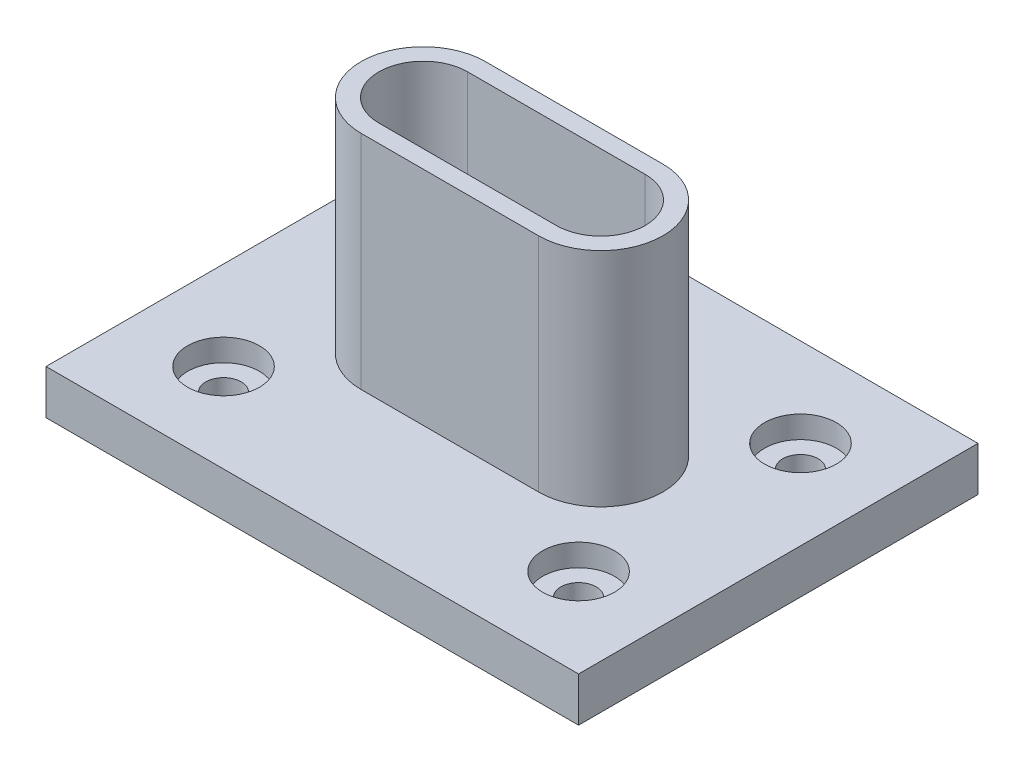
ISO-10303-21;
HEADER;
FILE_DESCRIPTION(('STEP AP214'),'2;1');
FILE_NAME('part.step','',(''),(''),'','','');
FILE_SCHEMA(('AUTOMOTIVE_DESIGN { 1 0 10303 214 1 1 1 1 }'));
ENDSEC;
DATA;
#1=APPLICATION_CONTEXT('core data for automotive mechanical design processes');
#2=APPLICATION_PROTOCOL_DEFINITION('international standard','automotive_design',2000,#1);
#3=PRODUCT_CONTEXT('',#1,'mechanical');
#4=PRODUCT('Part','Part','',(#3));
#5=PRODUCT_RELATED_PRODUCT_CATEGORY('part','',(#4));
#6=PRODUCT_DEFINITION_FORMATION('','',#4);
#7=PRODUCT_DEFINITION_CONTEXT('part definition',#1,'design');
#8=PRODUCT_DEFINITION('design','',#6,#7);
#9=PRODUCT_DEFINITION_SHAPE('','',#8);
#10=(LENGTH_UNIT() NAMED_UNIT(*) SI_UNIT(.MILLI.,.METRE.));
#11=(NAMED_UNIT(*) PLANE_ANGLE_UNIT() SI_UNIT($,.RADIAN.));
#12=(NAMED_UNIT(*) SI_UNIT($,.STERADIAN.) SOLID_ANGLE_UNIT());
#13=UNCERTAINTY_MEASURE_WITH_UNIT(LENGTH_MEASURE(1.E-05),#10,'distance_accuracy_value','');
#14=(GEOMETRIC_REPRESENTATION_CONTEXT(3) GLOBAL_UNCERTAINTY_ASSIGNED_CONTEXT((#13)) GLOBAL_UNIT_ASSIGNED_CONTEXT((#10,
#11,#12)) REPRESENTATION_CONTEXT('',''));
#15=CARTESIAN_POINT('',(0.,0.,0.));
#16=DIRECTION('',(0.,0.,1.));
#17=DIRECTION('',(1.,0.,0.));
#18=AXIS2_PLACEMENT_3D('',#15,#16,#17);
#19=CARTESIAN_POINT('',(-50.8000000000002,-41.7960298322641,-31.75));
#20=DIRECTION('',(0.,1.,0.));
#21=DIRECTION('',(0.,0.,1.));
#22=AXIS2_PLACEMENT_3D('',#19,#20,#21);
#23=CYLINDRICAL_SURFACE('',#22,5.08000000000001);
#24=CARTESIAN_POINT('',(-50.8000000000002,-12.7,-31.75));
#25=DIRECTION('',(0.,1.,0.));
#26=DIRECTION('',(0.,0.,1.));
#27=AXIS2_PLACEMENT_3D('',#24,#25,#26);
#28=CIRCLE('',#27,5.08000000000001);
#29=CARTESIAN_POINT('',(-50.8000000000002,-12.7,-26.67));
#30=VERTEX_POINT('',#29);
#31=EDGE_CURVE('E178',#30,#30,#28,.F.);
#32=ORIENTED_EDGE('',*,*,#31,.T.);
#33=EDGE_LOOP('',(#32));
#34=FACE_BOUND('',#33,.T.);
#35=CARTESIAN_POINT('',(-50.8000000000002,-6.35,-31.75));
#36=DIRECTION('',(0.,1.,0.));
#37=DIRECTION('',(0.,0.,1.));
#38=AXIS2_PLACEMENT_3D('',#35,#36,#37);
#39=CIRCLE('',#38,5.08000000000001);
#40=CARTESIAN_POINT('',(-50.8000000000002,-6.35,-26.67));
#41=VERTEX_POINT('',#40);
#42=EDGE_CURVE('E439',#41,#41,#39,.T.);
#43=ORIENTED_EDGE('',*,*,#42,.T.);
#44=EDGE_LOOP('',(#43));
#45=FACE_BOUND('',#44,.T.);
#46=ADVANCED_FACE('F69',(#34,#45),#23,.F.);
#47=CARTESIAN_POINT('',(-50.8,-41.7960298322641,31.75));
#48=DIRECTION('',(0.,1.,0.));
#49=DIRECTION('',(0.,0.,1.));
#50=AXIS2_PLACEMENT_3D('',#47,#48,#49);
#51=CYLINDRICAL_SURFACE('',#50,5.08000000000001);
#52=CARTESIAN_POINT('',(-50.8,-12.7,31.75));
#53=DIRECTION('',(0.,1.,0.));
#54=DIRECTION('',(0.,0.,1.));
#55=AXIS2_PLACEMENT_3D('',#52,#53,#54);
#56=CIRCLE('',#55,5.08000000000001);
#57=CARTESIAN_POINT('',(-50.8,-12.7,36.83));
#58=VERTEX_POINT('',#57);
#59=EDGE_CURVE('E378',#58,#58,#56,.F.);
#60=ORIENTED_EDGE('',*,*,#59,.T.);
#61=EDGE_LOOP('',(#60));
#62=FACE_BOUND('',#61,.T.);
#63=CARTESIAN_POINT('',(-50.8,-6.35,31.75));
#64=DIRECTION('',(0.,1.,0.));
#65=DIRECTION('',(0.,0.,1.));
#66=AXIS2_PLACEMENT_3D('',#63,#64,#65);
#67=CIRCLE('',#66,5.08000000000001);
#68=CARTESIAN_POINT('',(-50.8,-6.35,36.83));
#69=VERTEX_POINT('',#68);
#70=EDGE_CURVE('E394',#69,#69,#67,.T.);
#71=ORIENTED_EDGE('',*,*,#70,.T.);
#72=EDGE_LOOP('',(#71));
#73=FACE_BOUND('',#72,.T.);
#74=ADVANCED_FACE('F306',(#62,#73),#51,.F.);
#75=CARTESIAN_POINT('',(50.8,-41.7960298322641,31.75));
#76=DIRECTION('',(0.,1.,0.));
#77=DIRECTION('',(0.,0.,1.));
#78=AXIS2_PLACEMENT_3D('',#75,#76,#77);
#79=CYLINDRICAL_SURFACE('',#78,5.08000000000001);
#80=CARTESIAN_POINT('',(50.8,-12.7,31.75));
#81=DIRECTION('',(0.,1.,0.));
#82=DIRECTION('',(0.,0.,1.));
#83=AXIS2_PLACEMENT_3D('',#80,#81,#82);
#84=CIRCLE('',#83,5.08000000000001);
#85=CARTESIAN_POINT('',(50.8,-12.7,36.83));
#86=VERTEX_POINT('',#85);
#87=EDGE_CURVE('E382',#86,#86,#84,.F.);
#88=ORIENTED_EDGE('',*,*,#87,.T.);
#89=EDGE_LOOP('',(#88));
#90=FACE_BOUND('',#89,.T.);
#91=CARTESIAN_POINT('',(50.8,-6.35,31.75));
#92=DIRECTION('',(0.,1.,0.));
#93=DIRECTION('',(0.,0.,1.));
#94=AXIS2_PLACEMENT_3D('',#91,#92,#93);
#95=CIRCLE('',#94,5.08000000000001);
#96=CARTESIAN_POINT('',(50.8,-6.35,36.83));
#97=VERTEX_POINT('',#96);
#98=EDGE_CURVE('E415',#97,#97,#95,.T.);
#99=ORIENTED_EDGE('',*,*,#98,.T.);
#100=EDGE_LOOP('',(#99));
#101=FACE_BOUND('',#100,.T.);
#102=ADVANCED_FACE('F313',(#90,#101),#79,.F.);
#103=CARTESIAN_POINT('',(50.7999999999998,-41.7960298322641,-31.75));
#104=DIRECTION('',(0.,1.,0.));
#105=DIRECTION('',(0.,0.,1.));
#106=AXIS2_PLACEMENT_3D('',#103,#104,#105);
#107=CYLINDRICAL_SURFACE('',#106,5.08000000000001);
#108=CARTESIAN_POINT('',(50.7999999999998,-12.7,-31.75));
#109=DIRECTION('',(0.,1.,0.));
#110=DIRECTION('',(0.,0.,1.));
#111=AXIS2_PLACEMENT_3D('',#108,#109,#110);
#112=CIRCLE('',#111,5.08000000000001);
#113=CARTESIAN_POINT('',(50.7999999999998,-12.7,-26.67));
#114=VERTEX_POINT('',#113);
#115=EDGE_CURVE('E385',#114,#114,#112,.F.);
#116=ORIENTED_EDGE('',*,*,#115,.T.);
#117=EDGE_LOOP('',(#116));
#118=FACE_BOUND('',#117,.T.);
#119=CARTESIAN_POINT('',(50.7999999999998,-6.35,-31.75));
#120=DIRECTION('',(0.,1.,0.));
#121=DIRECTION('',(0.,0.,1.));
#122=AXIS2_PLACEMENT_3D('',#119,#120,#121);
#123=CIRCLE('',#122,5.08000000000001);
#124=CARTESIAN_POINT('',(50.7999999999998,-6.35,-26.67));
#125=VERTEX_POINT('',#124);
#126=EDGE_CURVE('E427',#125,#125,#123,.T.);
#127=ORIENTED_EDGE('',*,*,#126,.T.);
#128=EDGE_LOOP('',(#127));
#129=FACE_BOUND('',#128,.T.);
#130=ADVANCED_FACE('F346',(#118,#129),#107,.F.);
#131=CARTESIAN_POINT('',(0.,0.,0.));
#132=DIRECTION('',(0.,1.,0.));
#133=DIRECTION('',(0.,0.,1.));
#134=AXIS2_PLACEMENT_3D('',#131,#132,#133);
#135=PLANE('',#134);
#136=CARTESIAN_POINT('',(50.8,0.,31.75));
#137=DIRECTION('',(0.,1.,0.));
#138=DIRECTION('',(0.,0.,1.));
#139=AXIS2_PLACEMENT_3D('',#136,#137,#138);
#140=CIRCLE('',#139,10.287);
#141=CARTESIAN_POINT('',(50.8,0.,42.037));
#142=VERTEX_POINT('',#141);
#143=EDGE_CURVE('E411',#142,#142,#140,.T.);
#144=ORIENTED_EDGE('',*,*,#143,.F.);
#145=EDGE_LOOP('',(#144));
#146=FACE_BOUND('',#145,.T.);
#147=CARTESIAN_POINT('',(50.7999999999998,0.,-31.75));
#148=DIRECTION('',(0.,1.,0.));
#149=DIRECTION('',(0.,0.,1.));
#150=AXIS2_PLACEMENT_3D('',#147,#148,#149);
#151=CIRCLE('',#150,10.287);
#152=CARTESIAN_POINT('',(50.7999999999998,0.,-21.463));
#153=VERTEX_POINT('',#152);
#154=EDGE_CURVE('E420',#153,#153,#151,.T.);
#155=ORIENTED_EDGE('',*,*,#154,.F.);
#156=EDGE_LOOP('',(#155));
#157=FACE_BOUND('',#156,.T.);
#158=CARTESIAN_POINT('',(-50.8000000000002,0.,-31.75));
#159=DIRECTION('',(0.,1.,0.));
#160=DIRECTION('',(0.,0.,1.));
#161=AXIS2_PLACEMENT_3D('',#158,#159,#160);
#162=CIRCLE('',#161,10.287);
#163=CARTESIAN_POINT('',(-50.8000000000002,0.,-21.463));
#164=VERTEX_POINT('',#163);
#165=EDGE_CURVE('E432',#164,#164,#162,.T.);
#166=ORIENTED_EDGE('',*,*,#165,.F.);
#167=EDGE_LOOP('',(#166));
#168=FACE_BOUND('',#167,.T.);
#169=CARTESIAN_POINT('',(-50.8,0.,31.75));
#170=DIRECTION('',(0.,1.,0.));
#171=DIRECTION('',(0.,0.,1.));
#172=AXIS2_PLACEMENT_3D('',#169,#170,#171);
#173=CIRCLE('',#172,10.287);
#174=CARTESIAN_POINT('',(-50.8,0.,42.037));
#175=VERTEX_POINT('',#174);
#176=EDGE_CURVE('E397',#175,#175,#173,.T.);
#177=ORIENTED_EDGE('',*,*,#176,.F.);
#178=EDGE_LOOP('',(#177));
#179=FACE_BOUND('',#178,.T.);
#180=DIRECTION('',(0.,0.,-1.));
#181=VECTOR('',#180,1.);
#182=CARTESIAN_POINT('',(-76.2,0.,0.));
#183=LINE('',#182,#181);
#184=CARTESIAN_POINT('',(-76.2,0.,57.15));
#185=VERTEX_POINT('',#184);
#186=CARTESIAN_POINT('',(-76.2,0.,-57.15));
#187=VERTEX_POINT('',#186);
#188=EDGE_CURVE('E232',#185,#187,#183,.T.);
#189=ORIENTED_EDGE('',*,*,#188,.F.);
#190=DIRECTION('',(-1.,0.,0.));
#191=VECTOR('',#190,1.);
#192=CARTESIAN_POINT('',(0.,0.,57.15));
#193=LINE('',#192,#191);
#194=CARTESIAN_POINT('',(76.2,0.,57.15));
#195=VERTEX_POINT('',#194);
#196=EDGE_CURVE('E263',#195,#185,#193,.T.);
#197=ORIENTED_EDGE('',*,*,#196,.F.);
#198=DIRECTION('',(0.,0.,-1.));
#199=VECTOR('',#198,1.);
#200=CARTESIAN_POINT('',(76.2,0.,0.));
#201=LINE('',#200,#199);
#202=CARTESIAN_POINT('',(76.2,0.,-57.15));
#203=VERTEX_POINT('',#202);
#204=EDGE_CURVE('E266',#195,#203,#201,.T.);
#205=ORIENTED_EDGE('',*,*,#204,.T.);
#206=DIRECTION('',(-1.,0.,0.));
#207=VECTOR('',#206,1.);
#208=CARTESIAN_POINT('',(0.,0.,-57.15));
#209=LINE('',#208,#207);
#210=EDGE_CURVE('E236',#203,#187,#209,.T.);
#211=ORIENTED_EDGE('',*,*,#210,.T.);
#212=EDGE_LOOP('',(#189,#197,#205,#211));
#213=FACE_BOUND('',#212,.T.);
#214=DIRECTION('',(1.,0.,0.));
#215=VECTOR('',#214,1.);
#216=CARTESIAN_POINT('',(-25.4,0.,17.78));
#217=LINE('',#216,#215);
#218=CARTESIAN_POINT('',(-25.4,0.,17.78));
#219=VERTEX_POINT('',#218);
#220=CARTESIAN_POINT('',(25.4,0.,17.78));
#221=VERTEX_POINT('',#220);
#222=EDGE_CURVE('E87',#219,#221,#217,.T.);
#223=ORIENTED_EDGE('',*,*,#222,.F.);
#224=CARTESIAN_POINT('',(-25.4,0.,0.));
#225=DIRECTION('',(0.,1.,0.));
#226=DIRECTION('',(1.,0.,0.));
#227=AXIS2_PLACEMENT_3D('',#224,#225,#226);
#228=CIRCLE('',#227,17.78);
#229=CARTESIAN_POINT('',(-25.4,0.,-17.78));
#230=VERTEX_POINT('',#229);
#231=EDGE_CURVE('E192',#230,#219,#228,.T.);
#232=ORIENTED_EDGE('',*,*,#231,.F.);
#233=DIRECTION('',(1.,0.,0.));
#234=VECTOR('',#233,1.);
#235=CARTESIAN_POINT('',(-25.4,0.,-17.78));
#236=LINE('',#235,#234);
#237=CARTESIAN_POINT('',(25.4,0.,-17.78));
#238=VERTEX_POINT('',#237);
#239=EDGE_CURVE('E198',#230,#238,#236,.T.);
#240=ORIENTED_EDGE('',*,*,#239,.T.);
#241=CARTESIAN_POINT('',(25.4,0.,0.));
#242=DIRECTION('',(0.,1.,0.));
#243=DIRECTION('',(1.,0.,0.));
#244=AXIS2_PLACEMENT_3D('',#241,#242,#243);
#245=CIRCLE('',#244,17.78);
#246=EDGE_CURVE('E92',#221,#238,#245,.T.);
#247=ORIENTED_EDGE('',*,*,#246,.F.);
#248=EDGE_LOOP('',(#223,#232,#240,#247));
#249=FACE_BOUND('',#248,.T.);
#250=ADVANCED_FACE('F342',(#146,#157,#168,#179,#213,#249),#135,.T.);
#251=CARTESIAN_POINT('',(-76.2,-12.7,0.));
#252=DIRECTION('',(1.,0.,0.));
#253=DIRECTION('',(0.,0.,-1.));
#254=AXIS2_PLACEMENT_3D('',#251,#252,#253);
#255=PLANE('',#254);
#256=ORIENTED_EDGE('',*,*,#188,.T.);
#257=DIRECTION('',(0.,1.,0.));
#258=VECTOR('',#257,1.);
#259=CARTESIAN_POINT('',(-76.2,-12.7,-57.15));
#260=LINE('',#259,#258);
#261=CARTESIAN_POINT('',(-76.2,-12.7,-57.15));
#262=VERTEX_POINT('',#261);
#263=EDGE_CURVE('E12',#262,#187,#260,.T.);
#264=ORIENTED_EDGE('',*,*,#263,.F.);
#265=DIRECTION('',(0.,0.,-1.));
#266=VECTOR('',#265,1.);
#267=CARTESIAN_POINT('',(-76.2,-12.7,0.));
#268=LINE('',#267,#266);
#269=CARTESIAN_POINT('',(-76.2,-12.7,57.15));
#270=VERTEX_POINT('',#269);
#271=EDGE_CURVE('E246',#270,#262,#268,.T.);
#272=ORIENTED_EDGE('',*,*,#271,.F.);
#273=DIRECTION('',(0.,1.,0.));
#274=VECTOR('',#273,1.);
#275=CARTESIAN_POINT('',(-76.2,-12.7,57.15));
#276=LINE('',#275,#274);
#277=EDGE_CURVE('E278',#270,#185,#276,.T.);
#278=ORIENTED_EDGE('',*,*,#277,.T.);
#279=EDGE_LOOP('',(#256,#264,#272,#278));
#280=FACE_BOUND('',#279,.T.);
#281=ADVANCED_FACE('F345',(#280),#255,.F.);
#282=CARTESIAN_POINT('',(0.,-12.7,-57.15));
#283=DIRECTION('',(0.,0.,-1.));
#284=DIRECTION('',(-1.,0.,0.));
#285=AXIS2_PLACEMENT_3D('',#282,#283,#284);
#286=PLANE('',#285);
#287=ORIENTED_EDGE('',*,*,#210,.F.);
#288=DIRECTION('',(0.,1.,0.));
#289=VECTOR('',#288,1.);
#290=CARTESIAN_POINT('',(76.2,-12.7,-57.15));
#291=LINE('',#290,#289);
#292=CARTESIAN_POINT('',(76.2,-12.7,-57.15));
#293=VERTEX_POINT('',#292);
#294=EDGE_CURVE('E79',#293,#203,#291,.T.);
#295=ORIENTED_EDGE('',*,*,#294,.F.);
#296=DIRECTION('',(-1.,0.,0.));
#297=VECTOR('',#296,1.);
#298=CARTESIAN_POINT('',(0.,-12.7,-57.15));
#299=LINE('',#298,#297);
#300=EDGE_CURVE('E256',#293,#262,#299,.T.);
#301=ORIENTED_EDGE('',*,*,#300,.T.);
#302=ORIENTED_EDGE('',*,*,#263,.T.);
#303=EDGE_LOOP('',(#287,#295,#301,#302));
#304=FACE_BOUND('',#303,.T.);
#305=ADVANCED_FACE('F348',(#304),#286,.T.);
#306=CARTESIAN_POINT('',(76.2,-12.7,0.));
#307=DIRECTION('',(1.,0.,0.));
#308=DIRECTION('',(0.,0.,-1.));
#309=AXIS2_PLACEMENT_3D('',#306,#307,#308);
#310=PLANE('',#309);
#311=ORIENTED_EDGE('',*,*,#204,.F.);
#312=DIRECTION('',(0.,1.,0.));
#313=VECTOR('',#312,1.);
#314=CARTESIAN_POINT('',(76.2,-12.7,57.15));
#315=LINE('',#314,#313);
#316=CARTESIAN_POINT('',(76.2,-12.7,57.15));
#317=VERTEX_POINT('',#316);
#318=EDGE_CURVE('E275',#317,#195,#315,.T.);
#319=ORIENTED_EDGE('',*,*,#318,.F.);
#320=DIRECTION('',(0.,0.,-1.));
#321=VECTOR('',#320,1.);
#322=CARTESIAN_POINT('',(76.2,-12.7,0.));
#323=LINE('',#322,#321);
#324=EDGE_CURVE('E252',#317,#293,#323,.T.);
#325=ORIENTED_EDGE('',*,*,#324,.T.);
#326=ORIENTED_EDGE('',*,*,#294,.T.);
#327=EDGE_LOOP('',(#311,#319,#325,#326));
#328=FACE_BOUND('',#327,.T.);
#329=ADVANCED_FACE('F303',(#328),#310,.T.);
#330=CARTESIAN_POINT('',(25.4,-12.7,0.));
#331=DIRECTION('',(0.,1.,0.));
#332=DIRECTION('',(0.,0.,1.));
#333=AXIS2_PLACEMENT_3D('',#330,#331,#332);
#334=CYLINDRICAL_SURFACE('',#333,12.7);
#335=DIRECTION('',(0.,1.,0.));
#336=VECTOR('',#335,1.);
#337=CARTESIAN_POINT('',(25.4,-12.7,12.7));
#338=LINE('',#337,#336);
#339=CARTESIAN_POINT('',(25.4,-12.7,12.7));
#340=VERTEX_POINT('',#339);
#341=CARTESIAN_POINT('',(25.4,63.5,12.7));
#342=VERTEX_POINT('',#341);
#343=EDGE_CURVE('E73',#340,#342,#338,.T.);
#344=ORIENTED_EDGE('',*,*,#343,.T.);
#345=CARTESIAN_POINT('',(25.4,63.5,0.));
#346=DIRECTION('',(0.,1.,0.));
#347=DIRECTION('',(0.,0.,1.));
#348=AXIS2_PLACEMENT_3D('',#345,#346,#347);
#349=CIRCLE('',#348,12.7);
#350=CARTESIAN_POINT('',(25.4,63.5,-12.7));
#351=VERTEX_POINT('',#350);
#352=EDGE_CURVE('E182',#342,#351,#349,.T.);
#353=ORIENTED_EDGE('',*,*,#352,.T.);
#354=DIRECTION('',(0.,1.,0.));
#355=VECTOR('',#354,1.);
#356=CARTESIAN_POINT('',(25.4,-12.7,-12.7));
#357=LINE('',#356,#355);
#358=CARTESIAN_POINT('',(25.4,-12.7,-12.7));
#359=VERTEX_POINT('',#358);
#360=EDGE_CURVE('E282',#359,#351,#357,.T.);
#361=ORIENTED_EDGE('',*,*,#360,.F.);
#362=CARTESIAN_POINT('',(25.4,-12.7,0.));
#363=DIRECTION('',(0.,1.,0.));
#364=DIRECTION('',(0.,0.,1.));
#365=AXIS2_PLACEMENT_3D('',#362,#363,#364);
#366=CIRCLE('',#365,12.7);
#367=EDGE_CURVE('E233',#340,#359,#366,.T.);
#368=ORIENTED_EDGE('',*,*,#367,.F.);
#369=EDGE_LOOP('',(#344,#353,#361,#368));
#370=FACE_BOUND('',#369,.T.);
#371=ADVANCED_FACE('F71',(#370),#334,.F.);
#372=CARTESIAN_POINT('',(0.,-12.7,-12.7));
#373=DIRECTION('',(0.,0.,1.));
#374=DIRECTION('',(1.,0.,0.));
#375=AXIS2_PLACEMENT_3D('',#372,#373,#374);
#376=PLANE('',#375);
#377=ORIENTED_EDGE('',*,*,#360,.T.);
#378=DIRECTION('',(1.,0.,0.));
#379=VECTOR('',#378,1.);
#380=CARTESIAN_POINT('',(-25.4,63.5,-12.7));
#381=LINE('',#380,#379);
#382=CARTESIAN_POINT('',(-25.4,63.5,-12.7));
#383=VERTEX_POINT('',#382);
#384=EDGE_CURVE('E186',#383,#351,#381,.T.);
#385=ORIENTED_EDGE('',*,*,#384,.F.);
#386=DIRECTION('',(0.,1.,0.));
#387=VECTOR('',#386,1.);
#388=CARTESIAN_POINT('',(-25.4,-12.7,-12.7));
#389=LINE('',#388,#387);
#390=CARTESIAN_POINT('',(-25.4,-12.7,-12.7));
#391=VERTEX_POINT('',#390);
#392=EDGE_CURVE('E170',#391,#383,#389,.T.);
#393=ORIENTED_EDGE('',*,*,#392,.F.);
#394=DIRECTION('',(1.,0.,0.));
#395=VECTOR('',#394,1.);
#396=CARTESIAN_POINT('',(0.,-12.7,-12.7));
#397=LINE('',#396,#395);
#398=EDGE_CURVE('E242',#391,#359,#397,.T.);
#399=ORIENTED_EDGE('',*,*,#398,.T.);
#400=EDGE_LOOP('',(#377,#385,#393,#399));
#401=FACE_BOUND('',#400,.T.);
#402=ADVANCED_FACE('F295',(#401),#376,.T.);
#403=CARTESIAN_POINT('',(-25.4,-12.7,0.));
#404=DIRECTION('',(0.,1.,0.));
#405=DIRECTION('',(0.,0.,1.));
#406=AXIS2_PLACEMENT_3D('',#403,#404,#405);
#407=CYLINDRICAL_SURFACE('',#406,12.7);
#408=ORIENTED_EDGE('',*,*,#392,.T.);
#409=CARTESIAN_POINT('',(-25.4,63.5,0.));
#410=DIRECTION('',(0.,1.,0.));
#411=DIRECTION('',(0.,0.,1.));
#412=AXIS2_PLACEMENT_3D('',#409,#410,#411);
#413=CIRCLE('',#412,12.7);
#414=CARTESIAN_POINT('',(-25.4,63.5,12.7));
#415=VERTEX_POINT('',#414);
#416=EDGE_CURVE('E172',#383,#415,#413,.T.);
#417=ORIENTED_EDGE('',*,*,#416,.T.);
#418=DIRECTION('',(0.,1.,0.));
#419=VECTOR('',#418,1.);
#420=CARTESIAN_POINT('',(-25.4,-12.7,12.7));
#421=LINE('',#420,#419);
#422=CARTESIAN_POINT('',(-25.4,-12.7,12.7));
#423=VERTEX_POINT('',#422);
#424=EDGE_CURVE('E159',#423,#415,#421,.T.);
#425=ORIENTED_EDGE('',*,*,#424,.F.);
#426=CARTESIAN_POINT('',(-25.4,-12.7,0.));
#427=DIRECTION('',(0.,1.,0.));
#428=DIRECTION('',(0.,0.,1.));
#429=AXIS2_PLACEMENT_3D('',#426,#427,#428);
#430=CIRCLE('',#429,12.7);
#431=EDGE_CURVE('E239',#391,#423,#430,.T.);
#432=ORIENTED_EDGE('',*,*,#431,.F.);
#433=EDGE_LOOP('',(#408,#417,#425,#432));
#434=FACE_BOUND('',#433,.T.);
#435=ADVANCED_FACE('F173',(#434),#407,.F.);
#436=CARTESIAN_POINT('',(0.,-12.7,12.7));
#437=DIRECTION('',(0.,0.,1.));
#438=DIRECTION('',(1.,0.,0.));
#439=AXIS2_PLACEMENT_3D('',#436,#437,#438);
#440=PLANE('',#439);
#441=ORIENTED_EDGE('',*,*,#424,.T.);
#442=DIRECTION('',(1.,0.,0.));
#443=VECTOR('',#442,1.);
#444=CARTESIAN_POINT('',(-25.4,63.5,12.7));
#445=LINE('',#444,#443);
#446=EDGE_CURVE('E164',#415,#342,#445,.T.);
#447=ORIENTED_EDGE('',*,*,#446,.T.);
#448=ORIENTED_EDGE('',*,*,#343,.F.);
#449=DIRECTION('',(1.,0.,0.));
#450=VECTOR('',#449,1.);
#451=CARTESIAN_POINT('',(0.,-12.7,12.7));
#452=LINE('',#451,#450);
#453=EDGE_CURVE('E166',#423,#340,#452,.T.);
#454=ORIENTED_EDGE('',*,*,#453,.F.);
#455=EDGE_LOOP('',(#441,#447,#448,#454));
#456=FACE_BOUND('',#455,.T.);
#457=ADVANCED_FACE('F161',(#456),#440,.F.);
#458=CARTESIAN_POINT('',(0.,-12.7,57.15));
#459=DIRECTION('',(0.,0.,-1.));
#460=DIRECTION('',(-1.,0.,0.));
#461=AXIS2_PLACEMENT_3D('',#458,#459,#460);
#462=PLANE('',#461);
#463=ORIENTED_EDGE('',*,*,#196,.T.);
#464=ORIENTED_EDGE('',*,*,#277,.F.);
#465=DIRECTION('',(-1.,0.,0.));
#466=VECTOR('',#465,1.);
#467=CARTESIAN_POINT('',(0.,-12.7,57.15));
#468=LINE('',#467,#466);
#469=EDGE_CURVE('E249',#317,#270,#468,.T.);
#470=ORIENTED_EDGE('',*,*,#469,.F.);
#471=ORIENTED_EDGE('',*,*,#318,.T.);
#472=EDGE_LOOP('',(#463,#464,#470,#471));
#473=FACE_BOUND('',#472,.T.);
#474=ADVANCED_FACE('F341',(#473),#462,.F.);
#475=CARTESIAN_POINT('',(0.,-12.7,0.));
#476=DIRECTION('',(0.,1.,0.));
#477=DIRECTION('',(0.,0.,1.));
#478=AXIS2_PLACEMENT_3D('',#475,#476,#477);
#479=PLANE('',#478);
#480=ORIENTED_EDGE('',*,*,#367,.T.);
#481=ORIENTED_EDGE('',*,*,#398,.F.);
#482=ORIENTED_EDGE('',*,*,#431,.T.);
#483=ORIENTED_EDGE('',*,*,#453,.T.);
#484=EDGE_LOOP('',(#480,#481,#482,#483));
#485=FACE_BOUND('',#484,.T.);
#486=ORIENTED_EDGE('',*,*,#271,.T.);
#487=ORIENTED_EDGE('',*,*,#300,.F.);
#488=ORIENTED_EDGE('',*,*,#324,.F.);
#489=ORIENTED_EDGE('',*,*,#469,.T.);
#490=EDGE_LOOP('',(#486,#487,#488,#489));
#491=FACE_BOUND('',#490,.T.);
#492=ORIENTED_EDGE('',*,*,#31,.F.);
#493=EDGE_LOOP('',(#492));
#494=FACE_BOUND('',#493,.T.);
#495=ORIENTED_EDGE('',*,*,#59,.F.);
#496=EDGE_LOOP('',(#495));
#497=FACE_BOUND('',#496,.T.);
#498=ORIENTED_EDGE('',*,*,#87,.F.);
#499=EDGE_LOOP('',(#498));
#500=FACE_BOUND('',#499,.T.);
#501=ORIENTED_EDGE('',*,*,#115,.F.);
#502=EDGE_LOOP('',(#501));
#503=FACE_BOUND('',#502,.T.);
#504=ADVANCED_FACE('F292',(#485,#491,#494,#497,#500,#503),#479,.F.);
#505=CARTESIAN_POINT('',(-25.4,63.5,0.));
#506=DIRECTION('',(0.,1.,0.));
#507=DIRECTION('',(0.,0.,1.));
#508=AXIS2_PLACEMENT_3D('',#505,#506,#507);
#509=PLANE('',#508);
#510=CARTESIAN_POINT('',(-25.4,63.5,0.));
#511=DIRECTION('',(0.,1.,0.));
#512=DIRECTION('',(1.,0.,0.));
#513=AXIS2_PLACEMENT_3D('',#510,#511,#512);
#514=CIRCLE('',#513,17.78);
#515=CARTESIAN_POINT('',(-25.4,63.5,-17.78));
#516=VERTEX_POINT('',#515);
#517=CARTESIAN_POINT('',(-25.4,63.5,17.78));
#518=VERTEX_POINT('',#517);
#519=EDGE_CURVE('E193',#516,#518,#514,.T.);
#520=ORIENTED_EDGE('',*,*,#519,.T.);
#521=DIRECTION('',(1.,0.,0.));
#522=VECTOR('',#521,1.);
#523=CARTESIAN_POINT('',(-25.4,63.5,17.78));
#524=LINE('',#523,#522);
#525=CARTESIAN_POINT('',(25.4,63.5,17.78));
#526=VERTEX_POINT('',#525);
#527=EDGE_CURVE('E197',#518,#526,#524,.T.);
#528=ORIENTED_EDGE('',*,*,#527,.T.);
#529=CARTESIAN_POINT('',(25.4,63.5,0.));
#530=DIRECTION('',(0.,1.,0.));
#531=DIRECTION('',(1.,0.,0.));
#532=AXIS2_PLACEMENT_3D('',#529,#530,#531);
#533=CIRCLE('',#532,17.78);
#534=CARTESIAN_POINT('',(25.4,63.5,-17.78));
#535=VERTEX_POINT('',#534);
#536=EDGE_CURVE('E201',#526,#535,#533,.T.);
#537=ORIENTED_EDGE('',*,*,#536,.T.);
#538=DIRECTION('',(1.,0.,0.));
#539=VECTOR('',#538,1.);
#540=CARTESIAN_POINT('',(-25.4,63.5,-17.78));
#541=LINE('',#540,#539);
#542=EDGE_CURVE('E204',#516,#535,#541,.T.);
#543=ORIENTED_EDGE('',*,*,#542,.F.);
#544=EDGE_LOOP('',(#520,#528,#537,#543));
#545=FACE_BOUND('',#544,.T.);
#546=ORIENTED_EDGE('',*,*,#446,.F.);
#547=ORIENTED_EDGE('',*,*,#416,.F.);
#548=ORIENTED_EDGE('',*,*,#384,.T.);
#549=ORIENTED_EDGE('',*,*,#352,.F.);
#550=EDGE_LOOP('',(#546,#547,#548,#549));
#551=FACE_BOUND('',#550,.T.);
#552=ADVANCED_FACE('F180',(#545,#551),#509,.T.);
#553=CARTESIAN_POINT('',(-25.4,63.5,0.));
#554=DIRECTION('',(0.,-1.,0.));
#555=DIRECTION('',(0.,0.,-1.));
#556=AXIS2_PLACEMENT_3D('',#553,#554,#555);
#557=CYLINDRICAL_SURFACE('',#556,17.78);
#558=ORIENTED_EDGE('',*,*,#231,.T.);
#559=DIRECTION('',(0.,-1.,0.));
#560=VECTOR('',#559,1.);
#561=CARTESIAN_POINT('',(-25.4,63.5,17.78));
#562=LINE('',#561,#560);
#563=EDGE_CURVE('E229',#518,#219,#562,.T.);
#564=ORIENTED_EDGE('',*,*,#563,.F.);
#565=ORIENTED_EDGE('',*,*,#519,.F.);
#566=DIRECTION('',(0.,-1.,0.));
#567=VECTOR('',#566,1.);
#568=CARTESIAN_POINT('',(-25.4,63.5,-17.78));
#569=LINE('',#568,#567);
#570=EDGE_CURVE('E208',#516,#230,#569,.T.);
#571=ORIENTED_EDGE('',*,*,#570,.T.);
#572=EDGE_LOOP('',(#558,#564,#565,#571));
#573=FACE_BOUND('',#572,.T.);
#574=ADVANCED_FACE('F322',(#573),#557,.T.);
#575=CARTESIAN_POINT('',(-25.4,63.5,17.78));
#576=DIRECTION('',(0.,0.,-1.));
#577=DIRECTION('',(-1.,0.,0.));
#578=AXIS2_PLACEMENT_3D('',#575,#576,#577);
#579=PLANE('',#578);
#580=ORIENTED_EDGE('',*,*,#222,.T.);
#581=DIRECTION('',(0.,-1.,0.));
#582=VECTOR('',#581,1.);
#583=CARTESIAN_POINT('',(25.4,63.5,17.78));
#584=LINE('',#583,#582);
#585=EDGE_CURVE('E225',#526,#221,#584,.T.);
#586=ORIENTED_EDGE('',*,*,#585,.F.);
#587=ORIENTED_EDGE('',*,*,#527,.F.);
#588=ORIENTED_EDGE('',*,*,#563,.T.);
#589=EDGE_LOOP('',(#580,#586,#587,#588));
#590=FACE_BOUND('',#589,.T.);
#591=ADVANCED_FACE('F332',(#590),#579,.F.);
#592=CARTESIAN_POINT('',(25.4,63.5,0.));
#593=DIRECTION('',(0.,-1.,0.));
#594=DIRECTION('',(0.,0.,-1.));
#595=AXIS2_PLACEMENT_3D('',#592,#593,#594);
#596=CYLINDRICAL_SURFACE('',#595,17.78);
#597=ORIENTED_EDGE('',*,*,#246,.T.);
#598=DIRECTION('',(0.,-1.,0.));
#599=VECTOR('',#598,1.);
#600=CARTESIAN_POINT('',(25.4,63.5,-17.78));
#601=LINE('',#600,#599);
#602=EDGE_CURVE('E221',#535,#238,#601,.T.);
#603=ORIENTED_EDGE('',*,*,#602,.F.);
#604=ORIENTED_EDGE('',*,*,#536,.F.);
#605=ORIENTED_EDGE('',*,*,#585,.T.);
#606=EDGE_LOOP('',(#597,#603,#604,#605));
#607=FACE_BOUND('',#606,.T.);
#608=ADVANCED_FACE('F328',(#607),#596,.T.);
#609=CARTESIAN_POINT('',(-25.4,63.5,-17.78));
#610=DIRECTION('',(0.,0.,-1.));
#611=DIRECTION('',(-1.,0.,0.));
#612=AXIS2_PLACEMENT_3D('',#609,#610,#611);
#613=PLANE('',#612);
#614=ORIENTED_EDGE('',*,*,#239,.F.);
#615=ORIENTED_EDGE('',*,*,#570,.F.);
#616=ORIENTED_EDGE('',*,*,#542,.T.);
#617=ORIENTED_EDGE('',*,*,#602,.T.);
#618=EDGE_LOOP('',(#614,#615,#616,#617));
#619=FACE_BOUND('',#618,.T.);
#620=ADVANCED_FACE('F324',(#619),#613,.T.);
#621=CARTESIAN_POINT('',(50.7999999999998,-6.35,-31.75));
#622=DIRECTION('',(0.,1.,0.));
#623=DIRECTION('',(0.,0.,1.));
#624=AXIS2_PLACEMENT_3D('',#621,#622,#623);
#625=CYLINDRICAL_SURFACE('',#624,10.287);
#626=CARTESIAN_POINT('',(50.7999999999998,-6.35,-31.75));
#627=DIRECTION('',(0.,1.,0.));
#628=DIRECTION('',(0.,0.,1.));
#629=AXIS2_PLACEMENT_3D('',#626,#627,#628);
#630=CIRCLE('',#629,10.287);
#631=CARTESIAN_POINT('',(50.7999999999998,-6.35,-21.463));
#632=VERTEX_POINT('',#631);
#633=EDGE_CURVE('E428',#632,#632,#630,.T.);
#634=ORIENTED_EDGE('',*,*,#633,.F.);
#635=EDGE_LOOP('',(#634));
#636=FACE_BOUND('',#635,.T.);
#637=ORIENTED_EDGE('',*,*,#154,.T.);
#638=EDGE_LOOP('',(#637));
#639=FACE_BOUND('',#638,.T.);
#640=ADVANCED_FACE('F327',(#636,#639),#625,.F.);
#641=CARTESIAN_POINT('',(0.,-6.35,0.));
#642=DIRECTION('',(0.,1.,0.));
#643=DIRECTION('',(0.,0.,1.));
#644=AXIS2_PLACEMENT_3D('',#641,#642,#643);
#645=PLANE('',#644);
#646=ORIENTED_EDGE('',*,*,#126,.F.);
#647=EDGE_LOOP('',(#646));
#648=FACE_BOUND('',#647,.T.);
#649=ORIENTED_EDGE('',*,*,#633,.T.);
#650=EDGE_LOOP('',(#649));
#651=FACE_BOUND('',#650,.T.);
#652=ADVANCED_FACE('F491',(#648,#651),#645,.T.);
#653=CARTESIAN_POINT('',(50.8,-6.35,31.75));
#654=DIRECTION('',(0.,1.,0.));
#655=DIRECTION('',(0.,0.,1.));
#656=AXIS2_PLACEMENT_3D('',#653,#654,#655);
#657=CYLINDRICAL_SURFACE('',#656,10.287);
#658=CARTESIAN_POINT('',(50.8,-6.35,31.75));
#659=DIRECTION('',(0.,1.,0.));
#660=DIRECTION('',(0.,0.,1.));
#661=AXIS2_PLACEMENT_3D('',#658,#659,#660);
#662=CIRCLE('',#661,10.287);
#663=CARTESIAN_POINT('',(50.8,-6.35,42.037));
#664=VERTEX_POINT('',#663);
#665=EDGE_CURVE('E416',#664,#664,#662,.T.);
#666=ORIENTED_EDGE('',*,*,#665,.F.);
#667=EDGE_LOOP('',(#666));
#668=FACE_BOUND('',#667,.T.);
#669=ORIENTED_EDGE('',*,*,#143,.T.);
#670=EDGE_LOOP('',(#669));
#671=FACE_BOUND('',#670,.T.);
#672=ADVANCED_FACE('F473',(#668,#671),#657,.F.);
#673=CARTESIAN_POINT('',(0.,-6.35,0.));
#674=DIRECTION('',(0.,1.,0.));
#675=DIRECTION('',(0.,0.,1.));
#676=AXIS2_PLACEMENT_3D('',#673,#674,#675);
#677=PLANE('',#676);
#678=ORIENTED_EDGE('',*,*,#98,.F.);
#679=EDGE_LOOP('',(#678));
#680=FACE_BOUND('',#679,.T.);
#681=ORIENTED_EDGE('',*,*,#665,.T.);
#682=EDGE_LOOP('',(#681));
#683=FACE_BOUND('',#682,.T.);
#684=ADVANCED_FACE('F465',(#680,#683),#677,.T.);
#685=CARTESIAN_POINT('',(-50.8,-6.35,31.75));
#686=DIRECTION('',(0.,1.,0.));
#687=DIRECTION('',(0.,0.,1.));
#688=AXIS2_PLACEMENT_3D('',#685,#686,#687);
#689=CYLINDRICAL_SURFACE('',#688,10.287);
#690=CARTESIAN_POINT('',(-50.8,-6.35,31.75));
#691=DIRECTION('',(0.,1.,0.));
#692=DIRECTION('',(0.,0.,1.));
#693=AXIS2_PLACEMENT_3D('',#690,#691,#692);
#694=CIRCLE('',#693,10.287);
#695=CARTESIAN_POINT('',(-50.8,-6.35,42.037));
#696=VERTEX_POINT('',#695);
#697=EDGE_CURVE('E388',#696,#696,#694,.T.);
#698=ORIENTED_EDGE('',*,*,#697,.F.);
#699=EDGE_LOOP('',(#698));
#700=FACE_BOUND('',#699,.T.);
#701=ORIENTED_EDGE('',*,*,#176,.T.);
#702=EDGE_LOOP('',(#701));
#703=FACE_BOUND('',#702,.T.);
#704=ADVANCED_FACE('F463',(#700,#703),#689,.F.);
#705=CARTESIAN_POINT('',(0.,-6.35,0.));
#706=DIRECTION('',(0.,1.,0.));
#707=DIRECTION('',(0.,0.,1.));
#708=AXIS2_PLACEMENT_3D('',#705,#706,#707);
#709=PLANE('',#708);
#710=ORIENTED_EDGE('',*,*,#70,.F.);
#711=EDGE_LOOP('',(#710));
#712=FACE_BOUND('',#711,.T.);
#713=ORIENTED_EDGE('',*,*,#697,.T.);
#714=EDGE_LOOP('',(#713));
#715=FACE_BOUND('',#714,.T.);
#716=ADVANCED_FACE('F456',(#712,#715),#709,.T.);
#717=CARTESIAN_POINT('',(-50.8000000000002,-6.35,-31.75));
#718=DIRECTION('',(0.,1.,0.));
#719=DIRECTION('',(0.,0.,1.));
#720=AXIS2_PLACEMENT_3D('',#717,#718,#719);
#721=CYLINDRICAL_SURFACE('',#720,10.287);
#722=CARTESIAN_POINT('',(-50.8000000000002,-6.35,-31.75));
#723=DIRECTION('',(0.,1.,0.));
#724=DIRECTION('',(0.,0.,1.));
#725=AXIS2_PLACEMENT_3D('',#722,#723,#724);
#726=CIRCLE('',#725,10.287);
#727=CARTESIAN_POINT('',(-50.8000000000002,-6.35,-21.463));
#728=VERTEX_POINT('',#727);
#729=EDGE_CURVE('E409',#728,#728,#726,.T.);
#730=ORIENTED_EDGE('',*,*,#729,.F.);
#731=EDGE_LOOP('',(#730));
#732=FACE_BOUND('',#731,.T.);
#733=ORIENTED_EDGE('',*,*,#165,.T.);
#734=EDGE_LOOP('',(#733));
#735=FACE_BOUND('',#734,.T.);
#736=ADVANCED_FACE('F450',(#732,#735),#721,.F.);
#737=CARTESIAN_POINT('',(0.,-6.35,0.));
#738=DIRECTION('',(0.,1.,0.));
#739=DIRECTION('',(0.,0.,1.));
#740=AXIS2_PLACEMENT_3D('',#737,#738,#739);
#741=PLANE('',#740);
#742=ORIENTED_EDGE('',*,*,#42,.F.);
#743=EDGE_LOOP('',(#742));
#744=FACE_BOUND('',#743,.T.);
#745=ORIENTED_EDGE('',*,*,#729,.T.);
#746=EDGE_LOOP('',(#745));
#747=FACE_BOUND('',#746,.T.);
#748=ADVANCED_FACE('F447',(#744,#747),#741,.T.);
#749=CLOSED_SHELL('',(#46,#74,#102,#130,#250,#281,#305,#329,#371,#402,#435,#457,#474,#504,#552,
#574,#591,#608,#620,#640,#652,#672,#684,#704,#716,#736,#748));
#750=MANIFOLD_SOLID_BREP('B2',#749);
#751=ADVANCED_BREP_SHAPE_REPRESENTATION('',(#18,#750),#14);
#752=SHAPE_DEFINITION_REPRESENTATION(#9,#751);
ENDSEC;
END-ISO-10303-21;
